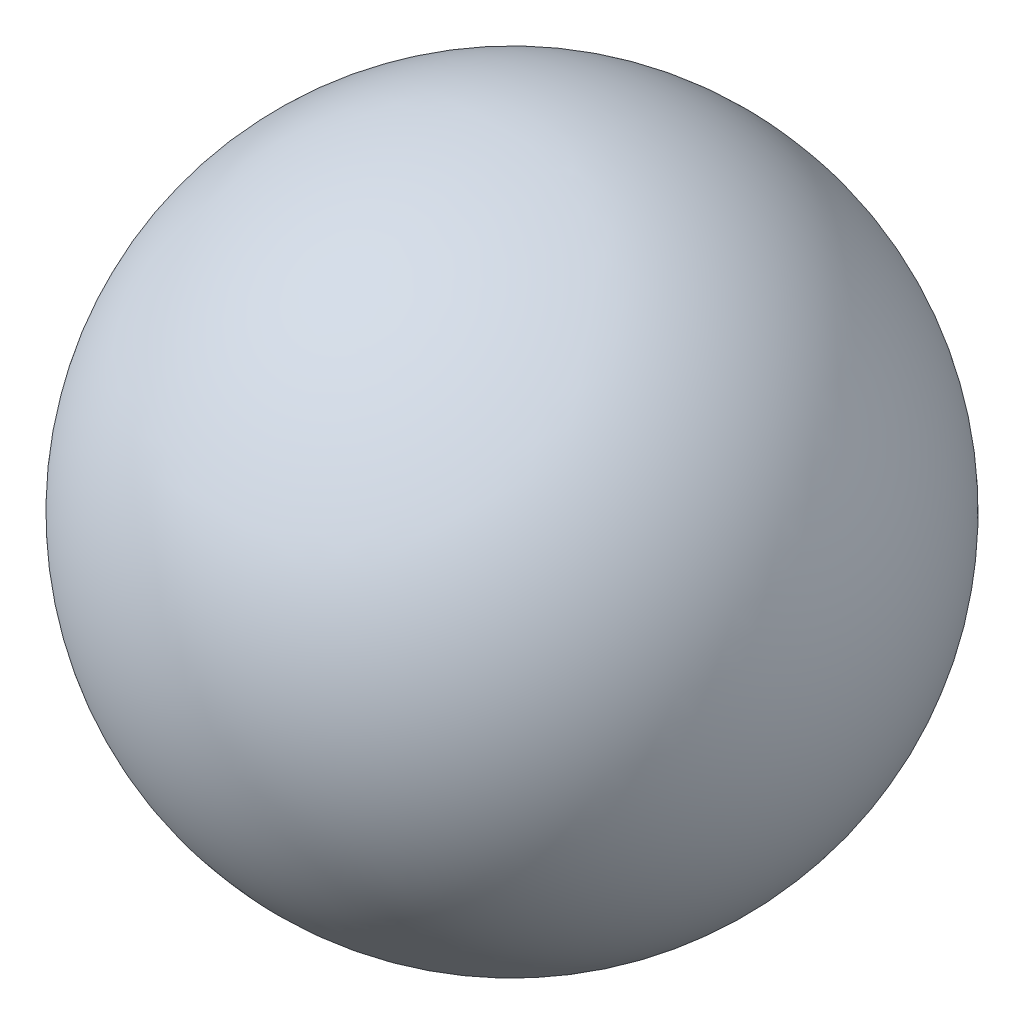
ISO-10303-21;
HEADER;
FILE_DESCRIPTION(('STEP AP214'),'2;1');
FILE_NAME('part.step','',(''),(''),'','','');
FILE_SCHEMA(('AUTOMOTIVE_DESIGN { 1 0 10303 214 1 1 1 1 }'));
ENDSEC;
DATA;
#1=APPLICATION_CONTEXT('core data for automotive mechanical design processes');
#2=APPLICATION_PROTOCOL_DEFINITION('international standard','automotive_design',2000,#1);
#3=PRODUCT_CONTEXT('',#1,'mechanical');
#4=PRODUCT('Part','Part','',(#3));
#5=PRODUCT_RELATED_PRODUCT_CATEGORY('part','',(#4));
#6=PRODUCT_DEFINITION_FORMATION('','',#4);
#7=PRODUCT_DEFINITION_CONTEXT('part definition',#1,'design');
#8=PRODUCT_DEFINITION('design','',#6,#7);
#9=PRODUCT_DEFINITION_SHAPE('','',#8);
#10=(LENGTH_UNIT() NAMED_UNIT(*) SI_UNIT(.MILLI.,.METRE.));
#11=(NAMED_UNIT(*) PLANE_ANGLE_UNIT() SI_UNIT($,.RADIAN.));
#12=(NAMED_UNIT(*) SI_UNIT($,.STERADIAN.) SOLID_ANGLE_UNIT());
#13=UNCERTAINTY_MEASURE_WITH_UNIT(LENGTH_MEASURE(1.E-05),#10,'distance_accuracy_value','');
#14=(GEOMETRIC_REPRESENTATION_CONTEXT(3) GLOBAL_UNCERTAINTY_ASSIGNED_CONTEXT((#13)) GLOBAL_UNIT_ASSIGNED_CONTEXT((#10,
#11,#12)) REPRESENTATION_CONTEXT('',''));
#15=CARTESIAN_POINT('',(0.,0.,0.));
#16=DIRECTION('',(0.,0.,1.));
#17=DIRECTION('',(1.,0.,0.));
#18=AXIS2_PLACEMENT_3D('',#15,#16,#17);
#19=CARTESIAN_POINT('',(49.75,27.9318117080106,-45.0417683373804));
#20=DIRECTION('',(0.,0.527020287134984,-0.849852703089282));
#21=DIRECTION('',(0.173648177666933,0.836941530920707,0.519013664765252));
#22=AXIS2_PLACEMENT_3D('',#19,#20,#21);
#23=SPHERICAL_SURFACE('',#22,5.95);
#24=CARTESIAN_POINT('',(49.75,24.7960409995574,-39.9851447539992));
#25=VERTEX_POINT('',#24);
#26=VERTEX_LOOP('',#25);
#27=FACE_BOUND('',#26,.T.);
#28=CARTESIAN_POINT('',(49.75,31.0675824164638,-50.0983919207616));
#29=VERTEX_POINT('',#28);
#30=VERTEX_LOOP('',#29);
#31=FACE_BOUND('',#30,.T.);
#32=ADVANCED_FACE('F16',(#27,#31),#23,.T.);
#33=CLOSED_SHELL('',(#32));
#34=MANIFOLD_SOLID_BREP('B1',#33);
#35=ADVANCED_BREP_SHAPE_REPRESENTATION('',(#18,#34),#14);
#36=SHAPE_DEFINITION_REPRESENTATION(#9,#35);
ENDSEC;
END-ISO-10303-21;
